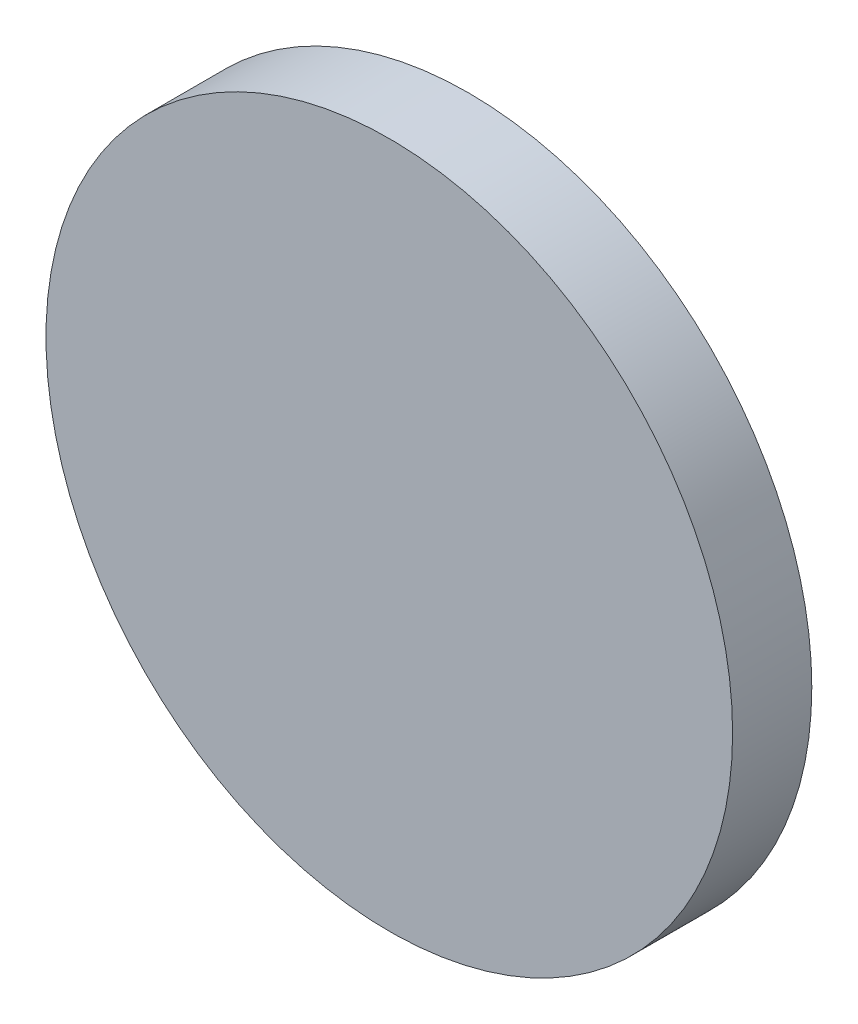
ISO-10303-21;
HEADER;
FILE_DESCRIPTION(('STEP AP214'),'2;1');
FILE_NAME('part.step','',(''),(''),'','','');
FILE_SCHEMA(('AUTOMOTIVE_DESIGN { 1 0 10303 214 1 1 1 1 }'));
ENDSEC;
DATA;
#1=APPLICATION_CONTEXT('core data for automotive mechanical design processes');
#2=APPLICATION_PROTOCOL_DEFINITION('international standard','automotive_design',2000,#1);
#3=PRODUCT_CONTEXT('',#1,'mechanical');
#4=PRODUCT('Part','Part','',(#3));
#5=PRODUCT_RELATED_PRODUCT_CATEGORY('part','',(#4));
#6=PRODUCT_DEFINITION_FORMATION('','',#4);
#7=PRODUCT_DEFINITION_CONTEXT('part definition',#1,'design');
#8=PRODUCT_DEFINITION('design','',#6,#7);
#9=PRODUCT_DEFINITION_SHAPE('','',#8);
#10=(LENGTH_UNIT() NAMED_UNIT(*) SI_UNIT(.MILLI.,.METRE.));
#11=(NAMED_UNIT(*) PLANE_ANGLE_UNIT() SI_UNIT($,.RADIAN.));
#12=(NAMED_UNIT(*) SI_UNIT($,.STERADIAN.) SOLID_ANGLE_UNIT());
#13=UNCERTAINTY_MEASURE_WITH_UNIT(LENGTH_MEASURE(1.E-05),#10,'distance_accuracy_value','');
#14=(GEOMETRIC_REPRESENTATION_CONTEXT(3) GLOBAL_UNCERTAINTY_ASSIGNED_CONTEXT((#13)) GLOBAL_UNIT_ASSIGNED_CONTEXT((#10,
#11,#12)) REPRESENTATION_CONTEXT('',''));
#15=CARTESIAN_POINT('',(0.,0.,0.));
#16=DIRECTION('',(0.,0.,1.));
#17=DIRECTION('',(1.,0.,0.));
#18=AXIS2_PLACEMENT_3D('',#15,#16,#17);
#19=CARTESIAN_POINT('',(0.,26.112,7.));
#20=DIRECTION('',(0.,0.,1.));
#21=DIRECTION('',(1.,0.,0.));
#22=AXIS2_PLACEMENT_3D('',#19,#20,#21);
#23=PLANE('',#22);
#24=CARTESIAN_POINT('',(0.,0.,7.));
#25=DIRECTION('',(0.,0.,1.));
#26=DIRECTION('',(1.,0.,0.));
#27=AXIS2_PLACEMENT_3D('',#24,#25,#26);
#28=CIRCLE('',#27,12.7);
#29=CARTESIAN_POINT('',(12.7,0.,7.));
#30=VERTEX_POINT('',#29);
#31=EDGE_CURVE('E18',#30,#30,#28,.F.);
#32=ORIENTED_EDGE('',*,*,#31,.F.);
#33=EDGE_LOOP('',(#32));
#34=FACE_BOUND('',#33,.T.);
#35=ADVANCED_FACE('F15',(#34),#23,.T.);
#36=CARTESIAN_POINT('',(0.,0.,4.07044074788857));
#37=DIRECTION('',(0.,0.,1.));
#38=DIRECTION('',(1.,0.,0.));
#39=AXIS2_PLACEMENT_3D('',#36,#37,#38);
#40=CYLINDRICAL_SURFACE('',#39,12.7);
#41=ORIENTED_EDGE('',*,*,#31,.T.);
#42=EDGE_LOOP('',(#41));
#43=FACE_BOUND('',#42,.T.);
#44=CARTESIAN_POINT('',(0.,0.,4.07044074788857));
#45=DIRECTION('',(0.,0.,-1.));
#46=DIRECTION('',(-1.,0.,0.));
#47=AXIS2_PLACEMENT_3D('',#44,#45,#46);
#48=CIRCLE('',#47,12.7);
#49=CARTESIAN_POINT('',(-12.7,0.,4.07044074788857));
#50=VERTEX_POINT('',#49);
#51=EDGE_CURVE('E9',#50,#50,#48,.T.);
#52=ORIENTED_EDGE('',*,*,#51,.F.);
#53=EDGE_LOOP('',(#52));
#54=FACE_BOUND('',#53,.T.);
#55=ADVANCED_FACE('F26',(#43,#54),#40,.T.);
#56=CARTESIAN_POINT('',(0.,12.7,4.07044074788857));
#57=CARTESIAN_POINT('',(-12.7,12.7,4.07044074788857));
#58=CARTESIAN_POINT('',(-12.7,0.,4.07044074788857));
#59=CARTESIAN_POINT('',(-12.7,-12.7,4.07044074788857));
#60=CARTESIAN_POINT('',(0.,-12.7,4.07044074788857));
#61=CARTESIAN_POINT('',(12.7,-12.7,4.07044074788857));
#62=CARTESIAN_POINT('',(12.7,0.,4.07044074788857));
#63=CARTESIAN_POINT('',(12.7,12.7,4.07044074788857));
#64=CARTESIAN_POINT('',(0.,12.7,4.07044074788857));
#65=CARTESIAN_POINT('',(0.,12.0047925406473,3.66706402275259));
#66=CARTESIAN_POINT('',(-12.0047925406473,12.0047925406473,3.66706402275259));
#67=CARTESIAN_POINT('',(-12.0047925406473,0.,3.66706402275259));
#68=CARTESIAN_POINT('',(-12.0047925406473,-12.0047925406473,3.66706402275259));
#69=CARTESIAN_POINT('',(0.,-12.0047925406473,3.66706402275259));
#70=CARTESIAN_POINT('',(12.0047925406473,-12.0047925406473,3.66706402275259));
#71=CARTESIAN_POINT('',(12.0047925406473,0.,3.66706402275259));
#72=CARTESIAN_POINT('',(12.0047925406473,12.0047925406473,3.66706402275259));
#73=CARTESIAN_POINT('',(0.,12.0047925406473,3.66706402275259));
#74=CARTESIAN_POINT('',(0.,11.1288216184859,3.18110437496482));
#75=CARTESIAN_POINT('',(-11.1288216184859,11.1288216184859,3.18110437496482));
#76=CARTESIAN_POINT('',(-11.1288216184859,0.,3.18110437496482));
#77=CARTESIAN_POINT('',(-11.1288216184859,-11.1288216184859,3.18110437496482));
#78=CARTESIAN_POINT('',(0.,-11.1288216184859,3.18110437496482));
#79=CARTESIAN_POINT('',(11.1288216184859,-11.1288216184859,3.18110437496482));
#80=CARTESIAN_POINT('',(11.1288216184859,0.,3.18110437496482));
#81=CARTESIAN_POINT('',(11.1288216184859,11.1288216184859,3.18110437496482));
#82=CARTESIAN_POINT('',(0.,11.1288216184859,3.18110437496482));
#83=CARTESIAN_POINT('',(0.,9.88680786784566,2.55141234971433));
#84=CARTESIAN_POINT('',(-9.88680786784566,9.88680786784566,2.55141234971433));
#85=CARTESIAN_POINT('',(-9.88680786784566,0.,2.55141234971433));
#86=CARTESIAN_POINT('',(-9.88680786784566,-9.88680786784565,2.55141234971433));
#87=CARTESIAN_POINT('',(0.,-9.88680786784566,2.55141234971433));
#88=CARTESIAN_POINT('',(9.88680786784565,-9.88680786784566,2.55141234971433));
#89=CARTESIAN_POINT('',(9.88680786784566,0.,2.55141234971433));
#90=CARTESIAN_POINT('',(9.88680786784566,9.88680786784565,2.55141234971433));
#91=CARTESIAN_POINT('',(0.,9.88680786784566,2.55141234971433));
#92=CARTESIAN_POINT('',(0.,9.18173750976835,2.21478518995643));
#93=CARTESIAN_POINT('',(-9.18173750976835,9.18173750976835,2.21478518995643));
#94=CARTESIAN_POINT('',(-9.18173750976835,0.,2.21478518995643));
#95=CARTESIAN_POINT('',(-9.18173750976835,-9.18173750976835,2.21478518995643));
#96=CARTESIAN_POINT('',(0.,-9.18173750976835,2.21478518995643));
#97=CARTESIAN_POINT('',(9.18173750976835,-9.18173750976835,2.21478518995643));
#98=CARTESIAN_POINT('',(9.18173750976835,0.,2.21478518995643));
#99=CARTESIAN_POINT('',(9.18173750976835,9.18173750976835,2.21478518995643));
#100=CARTESIAN_POINT('',(0.,9.18173750976835,2.21478518995643));
#101=CARTESIAN_POINT('',(0.,8.2996266482342,1.82288046403799));
#102=CARTESIAN_POINT('',(-8.2996266482342,8.2996266482342,1.82288046403799));
#103=CARTESIAN_POINT('',(-8.2996266482342,0.,1.82288046403799));
#104=CARTESIAN_POINT('',(-8.2996266482342,-8.2996266482342,1.82288046403799));
#105=CARTESIAN_POINT('',(0.,-8.2996266482342,1.82288046403799));
#106=CARTESIAN_POINT('',(8.2996266482342,-8.2996266482342,1.82288046403799));
#107=CARTESIAN_POINT('',(8.2996266482342,0.,1.82288046403799));
#108=CARTESIAN_POINT('',(8.2996266482342,8.2996266482342,1.82288046403799));
#109=CARTESIAN_POINT('',(0.,8.2996266482342,1.82288046403799));
#110=CARTESIAN_POINT('',(0.,7.59430124523877,1.53347095763193));
#111=CARTESIAN_POINT('',(-7.59430124523877,7.59430124523877,1.53347095763193));
#112=CARTESIAN_POINT('',(-7.59430124523877,0.,1.53347095763193));
#113=CARTESIAN_POINT('',(-7.59430124523877,-7.59430124523877,1.53347095763193));
#114=CARTESIAN_POINT('',(0.,-7.59430124523877,1.53347095763193));
#115=CARTESIAN_POINT('',(7.59430124523877,-7.59430124523877,1.53347095763193));
#116=CARTESIAN_POINT('',(7.59430124523877,0.,1.53347095763193));
#117=CARTESIAN_POINT('',(7.59430124523877,7.59430124523877,1.53347095763193));
#118=CARTESIAN_POINT('',(0.,7.59430124523877,1.53347095763193));
#119=CARTESIAN_POINT('',(0.,6.71163317217579,1.20388691326637));
#120=CARTESIAN_POINT('',(-6.71163317217579,6.71163317217579,1.20388691326637));
#121=CARTESIAN_POINT('',(-6.71163317217579,0.,1.20388691326637));
#122=CARTESIAN_POINT('',(-6.71163317217579,-6.71163317217579,1.20388691326637));
#123=CARTESIAN_POINT('',(0.,-6.71163317217579,1.20388691326637));
#124=CARTESIAN_POINT('',(6.71163317217579,-6.71163317217579,1.20388691326637));
#125=CARTESIAN_POINT('',(6.71163317217579,0.,1.20388691326637));
#126=CARTESIAN_POINT('',(6.71163317217579,6.71163317217579,1.20388691326637));
#127=CARTESIAN_POINT('',(0.,6.71163317217579,1.20388691326637));
#128=CARTESIAN_POINT('',(0.,6.00605514834142,0.966788217783462));
#129=CARTESIAN_POINT('',(-6.00605514834142,6.00605514834142,0.966788217783462));
#130=CARTESIAN_POINT('',(-6.00605514834142,0.,0.966788217783462));
#131=CARTESIAN_POINT('',(-6.00605514834142,-6.00605514834142,0.966788217783462));
#132=CARTESIAN_POINT('',(0.,-6.00605514834142,0.966788217783462));
#133=CARTESIAN_POINT('',(6.00605514834142,-6.00605514834142,0.966788217783462));
#134=CARTESIAN_POINT('',(6.00605514834142,0.,0.966788217783462));
#135=CARTESIAN_POINT('',(6.00605514834142,6.00605514834142,0.966788217783462));
#136=CARTESIAN_POINT('',(0.,6.00605514834142,0.966788217783462));
#137=CARTESIAN_POINT('',(0.,5.12286310887744,0.705093459212886));
#138=CARTESIAN_POINT('',(-5.12286310887744,5.12286310887744,0.705093459212886));
#139=CARTESIAN_POINT('',(-5.12286310887744,0.,0.705093459212886));
#140=CARTESIAN_POINT('',(-5.12286310887744,-5.12286310887744,0.705093459212886));
#141=CARTESIAN_POINT('',(0.,-5.12286310887744,0.705093459212886));
#142=CARTESIAN_POINT('',(5.12286310887744,-5.12286310887744,0.705093459212886));
#143=CARTESIAN_POINT('',(5.12286310887744,0.,0.705093459212886));
#144=CARTESIAN_POINT('',(5.12286310887744,5.12286310887744,0.705093459212886));
#145=CARTESIAN_POINT('',(0.,5.12286310887744,0.705093459212886));
#146=CARTESIAN_POINT('',(0.,4.41704869070313,0.524129911388462));
#147=CARTESIAN_POINT('',(-4.41704869070313,4.41704869070313,0.524129911388462));
#148=CARTESIAN_POINT('',(-4.41704869070313,0.,0.524129911388462));
#149=CARTESIAN_POINT('',(-4.41704869070313,-4.41704869070313,0.524129911388462));
#150=CARTESIAN_POINT('',(0.,-4.41704869070313,0.524129911388462));
#151=CARTESIAN_POINT('',(4.41704869070313,-4.41704869070313,0.524129911388462));
#152=CARTESIAN_POINT('',(4.41704869070313,0.,0.524129911388462));
#153=CARTESIAN_POINT('',(4.41704869070313,4.41704869070313,0.524129911388462));
#154=CARTESIAN_POINT('',(0.,4.41704869070313,0.524129911388462));
#155=CARTESIAN_POINT('',(0.,3.53340595721732,0.334420541636884));
#156=CARTESIAN_POINT('',(-3.53340595721732,3.53340595721732,0.334420541636884));
#157=CARTESIAN_POINT('',(-3.53340595721732,0.,0.334420541636884));
#158=CARTESIAN_POINT('',(-3.53340595721732,-3.53340595721732,0.334420541636884));
#159=CARTESIAN_POINT('',(0.,-3.53340595721732,0.334420541636884));
#160=CARTESIAN_POINT('',(3.53340595721732,-3.53340595721732,0.334420541636884));
#161=CARTESIAN_POINT('',(3.53340595721732,0.,0.334420541636884));
#162=CARTESIAN_POINT('',(3.53340595721732,3.53340595721732,0.334420541636884));
#163=CARTESIAN_POINT('',(0.,3.53340595721732,0.334420541636884));
#164=CARTESIAN_POINT('',(0.,2.82738597458447,0.212320671707835));
#165=CARTESIAN_POINT('',(-2.82738597458447,2.82738597458447,0.212320671707835));
#166=CARTESIAN_POINT('',(-2.82738597458447,0.,0.212320671707835));
#167=CARTESIAN_POINT('',(-2.82738597458447,-2.82738597458447,0.212320671707835));
#168=CARTESIAN_POINT('',(0.,-2.82738597458447,0.212320671707835));
#169=CARTESIAN_POINT('',(2.82738597458447,-2.82738597458447,0.212320671707835));
#170=CARTESIAN_POINT('',(2.82738597458447,0.,0.212320671707835));
#171=CARTESIAN_POINT('',(2.82738597458447,2.82738597458447,0.212320671707835));
#172=CARTESIAN_POINT('',(0.,2.82738597458447,0.212320671707835));
#173=CARTESIAN_POINT('',(0.,1.85582182368752,0.0860125720814905));
#174=CARTESIAN_POINT('',(-1.85582182368752,1.85582182368752,0.0860125720814905));
#175=CARTESIAN_POINT('',(-1.85582182368752,0.,0.0860125720814905));
#176=CARTESIAN_POINT('',(-1.85582182368752,-1.85582182368752,0.0860125720814905));
#177=CARTESIAN_POINT('',(0.,-1.85582182368752,0.0860125720814905));
#178=CARTESIAN_POINT('',(1.85582182368752,-1.85582182368752,0.0860125720814905));
#179=CARTESIAN_POINT('',(1.85582182368752,0.,0.0860125720814905));
#180=CARTESIAN_POINT('',(1.85582182368752,1.85582182368752,0.0860125720814905));
#181=CARTESIAN_POINT('',(0.,1.85582182368752,0.0860125720814905));
#182=CARTESIAN_POINT('',(0.,0.973113095451692,0.0154304858090202));
#183=CARTESIAN_POINT('',(-0.973113095451692,0.973113095451692,0.0154304858090202));
#184=CARTESIAN_POINT('',(-0.973113095451692,0.,0.0154304858090202));
#185=CARTESIAN_POINT('',(-0.973113095451692,-0.973113095451692,0.0154304858090202));
#186=CARTESIAN_POINT('',(0.,-0.973113095451692,0.0154304858090202));
#187=CARTESIAN_POINT('',(0.973113095451692,-0.973113095451693,0.0154304858090202));
#188=CARTESIAN_POINT('',(0.973113095451692,0.,0.0154304858090202));
#189=CARTESIAN_POINT('',(0.973113095451693,0.973113095451692,0.0154304858090202));
#190=CARTESIAN_POINT('',(0.,0.973113095451692,0.0154304858090202));
#191=CARTESIAN_POINT('',(0.,0.264832861695586,0.));
#192=CARTESIAN_POINT('',(-0.264832861695586,0.264832861695586,0.));
#193=CARTESIAN_POINT('',(-0.264832861695586,0.,0.));
#194=CARTESIAN_POINT('',(-0.264832861695586,-0.264832861695586,0.));
#195=CARTESIAN_POINT('',(0.,-0.264832861695586,0.));
#196=CARTESIAN_POINT('',(0.264832861695586,-0.264832861695586,0.));
#197=CARTESIAN_POINT('',(0.264832861695586,0.,0.));
#198=CARTESIAN_POINT('',(0.264832861695586,0.264832861695586,0.));
#199=CARTESIAN_POINT('',(0.,0.264832861695586,0.));
#200=CARTESIAN_POINT('',(0.,0.,0.));
#201=CARTESIAN_POINT('',(0.,0.,0.));
#202=CARTESIAN_POINT('',(0.,0.,0.));
#203=CARTESIAN_POINT('',(0.,0.,0.));
#204=CARTESIAN_POINT('',(0.,0.,0.));
#205=CARTESIAN_POINT('',(0.,0.,0.));
#206=CARTESIAN_POINT('',(0.,0.,0.));
#207=CARTESIAN_POINT('',(0.,0.,0.));
#208=CARTESIAN_POINT('',(0.,0.,0.));
#209=(BOUNDED_SURFACE() B_SPLINE_SURFACE(3,2,((#56,#57,#58,#59,#60,#61,#62,#63,#64),(#65,#66,
#67,#68,#69,#70,#71,#72,#73),(#74,#75,#76,#77,#78,#79,#80,#81,#82),(#83,#84,#85,#86,#87,#88,#89,
#90,#91),(#92,#93,#94,#95,#96,#97,#98,#99,#100),(#101,#102,#103,#104,#105,#106,#107,#108,#109),
(#110,#111,#112,#113,#114,#115,#116,#117,#118),(#119,#120,#121,#122,#123,#124,#125,#126,#127),
(#128,#129,#130,#131,#132,#133,#134,#135,#136),(#137,#138,#139,#140,#141,#142,#143,#144,#145),
(#146,#147,#148,#149,#150,#151,#152,#153,#154),(#155,#156,#157,#158,#159,#160,#161,#162,#163),
(#164,#165,#166,#167,#168,#169,#170,#171,#172),(#173,#174,#175,#176,#177,#178,#179,#180,#181),
(#182,#183,#184,#185,#186,#187,#188,#189,#190),(#191,#192,#193,#194,#195,#196,#197,#198,#199),
(#200,#201,#202,#203,#204,#205,#206,#207,#208)),.UNSPECIFIED.,.F.,.T.,
.F.) B_SPLINE_SURFACE_WITH_KNOTS((4,1,1,1,1,1,1,1,1,1,1,1,1,1,4),(3,2,2,2,3),(0.,
0.178650543343562,0.22259303623103,0.309424944405423,0.352314359692349,0.437044752892225,
0.478885730805176,0.561611430272628,0.60249615182713,0.683476697177007,0.723572520972383,
0.803202771758968,0.842737198750177,0.941135812870693,1.),(0.,90.,180.,270.,360.),
.UNSPECIFIED.) GEOMETRIC_REPRESENTATION_ITEM() RATIONAL_B_SPLINE_SURFACE(((1.,0.707106781186548,
1.,0.707106781186548,1.,0.707106781186548,1.,0.707106781186548,1.),(1.,0.707106781186548,1.,
0.707106781186548,1.,0.707106781186548,1.,0.707106781186548,1.),(1.,0.707106781186548,1.,
0.707106781186548,1.,0.707106781186548,1.,0.707106781186548,1.),(1.,0.707106781186548,1.,
0.707106781186548,1.,0.707106781186548,1.,0.707106781186548,1.),(1.,0.707106781186548,1.,
0.707106781186548,1.,0.707106781186548,1.,0.707106781186548,1.),(1.,0.707106781186548,1.,
0.707106781186548,1.,0.707106781186548,1.,0.707106781186548,1.),(1.,0.707106781186548,1.,
0.707106781186548,1.,0.707106781186548,1.,0.707106781186548,1.),(1.,0.707106781186548,1.,
0.707106781186548,1.,0.707106781186548,1.,0.707106781186548,1.),(1.,0.707106781186548,1.,
0.707106781186548,1.,0.707106781186548,1.,0.707106781186548,1.),(1.,0.707106781186548,1.,
0.707106781186548,1.,0.707106781186548,1.,0.707106781186548,1.),(1.,0.707106781186548,1.,
0.707106781186548,1.,0.707106781186548,1.,0.707106781186548,1.),(1.,0.707106781186548,1.,
0.707106781186548,1.,0.707106781186548,1.,0.707106781186548,1.),(1.,0.707106781186548,1.,
0.707106781186548,1.,0.707106781186548,1.,0.707106781186548,1.),(1.,0.707106781186548,1.,
0.707106781186548,1.,0.707106781186548,1.,0.707106781186548,1.),(1.,0.707106781186548,1.,
0.707106781186548,1.,0.707106781186548,1.,0.707106781186548,1.),(1.,0.707106781186548,1.,
0.707106781186548,1.,0.707106781186548,1.,0.707106781186548,1.),(1.,0.707106781186548,1.,
0.707106781186548,1.,0.707106781186548,1.,0.707106781186548,1.))) REPRESENTATION_ITEM('') SURFACE());
#210=ORIENTED_EDGE('',*,*,#51,.T.);
#211=EDGE_LOOP('',(#210));
#212=FACE_BOUND('',#211,.T.);
#213=CARTESIAN_POINT('',(0.,0.,0.));
#214=VERTEX_POINT('',#213);
#215=VERTEX_LOOP('',#214);
#216=FACE_BOUND('',#215,.T.);
#217=ADVANCED_FACE('F24',(#212,#216),#209,.T.);
#218=CLOSED_SHELL('',(#35,#55,#217));
#219=MANIFOLD_SOLID_BREP('B1',#218);
#220=ADVANCED_BREP_SHAPE_REPRESENTATION('',(#18,#219),#14);
#221=SHAPE_DEFINITION_REPRESENTATION(#9,#220);
ENDSEC;
END-ISO-10303-21;
